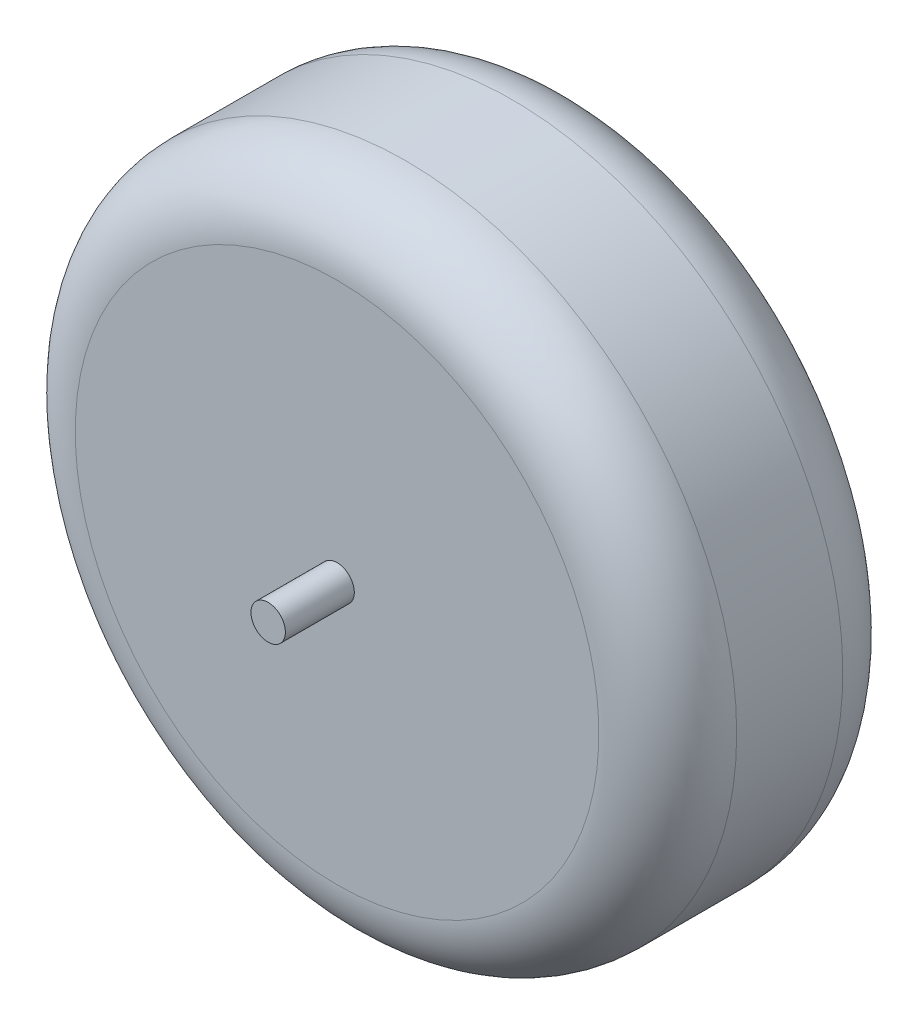
ISO-10303-21;
HEADER;
FILE_DESCRIPTION(('STEP AP214'),'2;1');
FILE_NAME('part.step','',(''),(''),'','','');
FILE_SCHEMA(('AUTOMOTIVE_DESIGN { 1 0 10303 214 1 1 1 1 }'));
ENDSEC;
DATA;
#1=APPLICATION_CONTEXT('core data for automotive mechanical design processes');
#2=APPLICATION_PROTOCOL_DEFINITION('international standard','automotive_design',2000,#1);
#3=PRODUCT_CONTEXT('',#1,'mechanical');
#4=PRODUCT('Part','Part','',(#3));
#5=PRODUCT_RELATED_PRODUCT_CATEGORY('part','',(#4));
#6=PRODUCT_DEFINITION_FORMATION('','',#4);
#7=PRODUCT_DEFINITION_CONTEXT('part definition',#1,'design');
#8=PRODUCT_DEFINITION('design','',#6,#7);
#9=PRODUCT_DEFINITION_SHAPE('','',#8);
#10=(LENGTH_UNIT() NAMED_UNIT(*) SI_UNIT(.MILLI.,.METRE.));
#11=(NAMED_UNIT(*) PLANE_ANGLE_UNIT() SI_UNIT($,.RADIAN.));
#12=(NAMED_UNIT(*) SI_UNIT($,.STERADIAN.) SOLID_ANGLE_UNIT());
#13=UNCERTAINTY_MEASURE_WITH_UNIT(LENGTH_MEASURE(1.E-05),#10,'distance_accuracy_value','');
#14=(GEOMETRIC_REPRESENTATION_CONTEXT(3) GLOBAL_UNCERTAINTY_ASSIGNED_CONTEXT((#13)) GLOBAL_UNIT_ASSIGNED_CONTEXT((#10,
#11,#12)) REPRESENTATION_CONTEXT('',''));
#15=CARTESIAN_POINT('',(0.,0.,0.));
#16=DIRECTION('',(0.,0.,1.));
#17=DIRECTION('',(1.,0.,0.));
#18=AXIS2_PLACEMENT_3D('',#15,#16,#17);
#19=CARTESIAN_POINT('',(0.,0.,13.85));
#20=DIRECTION('',(0.,0.,1.));
#21=DIRECTION('',(1.,0.,0.));
#22=AXIS2_PLACEMENT_3D('',#19,#20,#21);
#23=PLANE('',#22);
#24=CARTESIAN_POINT('',(0.,0.,13.85));
#25=DIRECTION('',(0.,0.,-1.));
#26=DIRECTION('',(-1.,0.,0.));
#27=AXIS2_PLACEMENT_3D('',#24,#25,#26);
#28=CIRCLE('',#27,1.25);
#29=CARTESIAN_POINT('',(-1.25,0.,13.85));
#30=VERTEX_POINT('',#29);
#31=EDGE_CURVE('E243',#30,#30,#28,.T.);
#32=ORIENTED_EDGE('',*,*,#31,.F.);
#33=EDGE_LOOP('',(#32));
#34=FACE_BOUND('',#33,.T.);
#35=ADVANCED_FACE('F17',(#34),#23,.T.);
#36=CARTESIAN_POINT('',(0.,0.,13.85));
#37=DIRECTION('',(0.,0.,-1.));
#38=DIRECTION('',(-1.,0.,0.));
#39=AXIS2_PLACEMENT_3D('',#36,#37,#38);
#40=CYLINDRICAL_SURFACE('',#39,1.25);
#41=CARTESIAN_POINT('',(0.,0.,8.85));
#42=DIRECTION('',(0.,0.,-1.));
#43=DIRECTION('',(-1.,0.,0.));
#44=AXIS2_PLACEMENT_3D('',#41,#42,#43);
#45=CIRCLE('',#44,1.25);
#46=CARTESIAN_POINT('',(-1.25,0.,8.85));
#47=VERTEX_POINT('',#46);
#48=EDGE_CURVE('E50',#47,#47,#45,.T.);
#49=ORIENTED_EDGE('',*,*,#48,.F.);
#50=EDGE_LOOP('',(#49));
#51=FACE_BOUND('',#50,.T.);
#52=ORIENTED_EDGE('',*,*,#31,.T.);
#53=EDGE_LOOP('',(#52));
#54=FACE_BOUND('',#53,.T.);
#55=ADVANCED_FACE('F181',(#51,#54),#40,.T.);
#56=CARTESIAN_POINT('',(0.,0.,8.85));
#57=DIRECTION('',(0.,0.,1.));
#58=DIRECTION('',(1.,0.,0.));
#59=AXIS2_PLACEMENT_3D('',#56,#57,#58);
#60=PLANE('',#59);
#61=CARTESIAN_POINT('',(0.,0.,8.85));
#62=DIRECTION('',(0.,0.,-1.));
#63=DIRECTION('',(0.,1.,0.));
#64=AXIS2_PLACEMENT_3D('',#61,#62,#63);
#65=CIRCLE('',#64,19.);
#66=CARTESIAN_POINT('',(0.,19.,8.85));
#67=VERTEX_POINT('',#66);
#68=CARTESIAN_POINT('',(0.,-19.,8.85));
#69=VERTEX_POINT('',#68);
#70=EDGE_CURVE('E42',#67,#69,#65,.T.);
#71=ORIENTED_EDGE('',*,*,#70,.F.);
#72=CARTESIAN_POINT('',(0.,0.,8.85));
#73=DIRECTION('',(0.,0.,-1.));
#74=DIRECTION('',(0.,-1.,0.));
#75=AXIS2_PLACEMENT_3D('',#72,#73,#74);
#76=CIRCLE('',#75,19.);
#77=EDGE_CURVE('E48',#69,#67,#76,.T.);
#78=ORIENTED_EDGE('',*,*,#77,.F.);
#79=EDGE_LOOP('',(#71,#78));
#80=FACE_BOUND('',#79,.T.);
#81=ORIENTED_EDGE('',*,*,#48,.T.);
#82=EDGE_LOOP('',(#81));
#83=FACE_BOUND('',#82,.T.);
#84=ADVANCED_FACE('F46',(#80,#83),#60,.T.);
#85=CARTESIAN_POINT('',(0.,0.,3.85));
#86=DIRECTION('',(0.,0.,1.));
#87=DIRECTION('',(0.,-1.,0.));
#88=AXIS2_PLACEMENT_3D('',#85,#86,#87);
#89=TOROIDAL_SURFACE('',#88,19.,5.);
#90=CARTESIAN_POINT('',(0.,0.,3.85));
#91=DIRECTION('',(0.,0.,-1.));
#92=DIRECTION('',(-1.,0.,0.));
#93=AXIS2_PLACEMENT_3D('',#90,#91,#92);
#94=CIRCLE('',#93,24.);
#95=CARTESIAN_POINT('',(-24.,0.,3.85));
#96=VERTEX_POINT('',#95);
#97=EDGE_CURVE('E55',#96,#96,#94,.T.);
#98=ORIENTED_EDGE('',*,*,#97,.F.);
#99=EDGE_LOOP('',(#98));
#100=FACE_BOUND('',#99,.T.);
#101=ORIENTED_EDGE('',*,*,#77,.T.);
#102=ORIENTED_EDGE('',*,*,#70,.T.);
#103=EDGE_LOOP('',(#101,#102));
#104=FACE_BOUND('',#103,.T.);
#105=ADVANCED_FACE('F54',(#100,#104),#89,.T.);
#106=CARTESIAN_POINT('',(0.,0.,-13.85));
#107=DIRECTION('',(0.,0.,-1.));
#108=DIRECTION('',(-1.,0.,0.));
#109=AXIS2_PLACEMENT_3D('',#106,#107,#108);
#110=PLANE('',#109);
#111=CARTESIAN_POINT('',(0.,0.,-13.85));
#112=DIRECTION('',(0.,0.,1.));
#113=DIRECTION('',(1.,0.,0.));
#114=AXIS2_PLACEMENT_3D('',#111,#112,#113);
#115=CIRCLE('',#114,1.25);
#116=CARTESIAN_POINT('',(1.25,0.,-13.85));
#117=VERTEX_POINT('',#116);
#118=EDGE_CURVE('E83',#117,#117,#115,.T.);
#119=ORIENTED_EDGE('',*,*,#118,.F.);
#120=EDGE_LOOP('',(#119));
#121=FACE_BOUND('',#120,.T.);
#122=ADVANCED_FACE('F74',(#121),#110,.T.);
#123=CARTESIAN_POINT('',(0.,0.,8.85));
#124=DIRECTION('',(0.,0.,-1.));
#125=DIRECTION('',(-1.,0.,0.));
#126=AXIS2_PLACEMENT_3D('',#123,#124,#125);
#127=CYLINDRICAL_SURFACE('',#126,24.);
#128=ORIENTED_EDGE('',*,*,#97,.T.);
#129=EDGE_LOOP('',(#128));
#130=FACE_BOUND('',#129,.T.);
#131=CARTESIAN_POINT('',(0.,0.,-3.85));
#132=DIRECTION('',(0.,0.,1.));
#133=DIRECTION('',(0.,-1.,0.));
#134=AXIS2_PLACEMENT_3D('',#131,#132,#133);
#135=CIRCLE('',#134,24.);
#136=CARTESIAN_POINT('',(0.,-24.,-3.85));
#137=VERTEX_POINT('',#136);
#138=EDGE_CURVE('E84',#137,#137,#135,.F.);
#139=ORIENTED_EDGE('',*,*,#138,.F.);
#140=EDGE_LOOP('',(#139));
#141=FACE_BOUND('',#140,.T.);
#142=ADVANCED_FACE('F130',(#130,#141),#127,.T.);
#143=CARTESIAN_POINT('',(0.,0.,-13.85));
#144=DIRECTION('',(0.,0.,1.));
#145=DIRECTION('',(1.,0.,0.));
#146=AXIS2_PLACEMENT_3D('',#143,#144,#145);
#147=CYLINDRICAL_SURFACE('',#146,1.25);
#148=ORIENTED_EDGE('',*,*,#118,.T.);
#149=EDGE_LOOP('',(#148));
#150=FACE_BOUND('',#149,.T.);
#151=CARTESIAN_POINT('',(0.,0.,-8.85));
#152=DIRECTION('',(0.,0.,1.));
#153=DIRECTION('',(1.,0.,0.));
#154=AXIS2_PLACEMENT_3D('',#151,#152,#153);
#155=CIRCLE('',#154,1.25);
#156=CARTESIAN_POINT('',(1.25,0.,-8.85));
#157=VERTEX_POINT('',#156);
#158=EDGE_CURVE('E64',#157,#157,#155,.F.);
#159=ORIENTED_EDGE('',*,*,#158,.T.);
#160=EDGE_LOOP('',(#159));
#161=FACE_BOUND('',#160,.T.);
#162=ADVANCED_FACE('F103',(#150,#161),#147,.T.);
#163=CARTESIAN_POINT('',(0.,0.,-3.85));
#164=DIRECTION('',(0.,0.,1.));
#165=DIRECTION('',(0.,-1.,0.));
#166=AXIS2_PLACEMENT_3D('',#163,#164,#165);
#167=TOROIDAL_SURFACE('',#166,19.,5.);
#168=CARTESIAN_POINT('',(0.,0.,-8.85));
#169=DIRECTION('',(0.,0.,1.));
#170=DIRECTION('',(0.,-1.,0.));
#171=AXIS2_PLACEMENT_3D('',#168,#169,#170);
#172=CIRCLE('',#171,19.);
#173=CARTESIAN_POINT('',(0.,-19.,-8.85));
#174=VERTEX_POINT('',#173);
#175=CARTESIAN_POINT('',(0.,19.,-8.85));
#176=VERTEX_POINT('',#175);
#177=EDGE_CURVE('E28',#174,#176,#172,.T.);
#178=ORIENTED_EDGE('',*,*,#177,.T.);
#179=CARTESIAN_POINT('',(0.,0.,-8.85));
#180=DIRECTION('',(0.,0.,1.));
#181=DIRECTION('',(0.,1.,0.));
#182=AXIS2_PLACEMENT_3D('',#179,#180,#181);
#183=CIRCLE('',#182,19.);
#184=EDGE_CURVE('E11',#176,#174,#183,.T.);
#185=ORIENTED_EDGE('',*,*,#184,.T.);
#186=EDGE_LOOP('',(#178,#185));
#187=FACE_BOUND('',#186,.T.);
#188=ORIENTED_EDGE('',*,*,#138,.T.);
#189=EDGE_LOOP('',(#188));
#190=FACE_BOUND('',#189,.T.);
#191=ADVANCED_FACE('F92',(#187,#190),#167,.T.);
#192=CARTESIAN_POINT('',(0.,0.,-8.85));
#193=DIRECTION('',(0.,0.,1.));
#194=DIRECTION('',(1.,0.,0.));
#195=AXIS2_PLACEMENT_3D('',#192,#193,#194);
#196=PLANE('',#195);
#197=ORIENTED_EDGE('',*,*,#177,.F.);
#198=ORIENTED_EDGE('',*,*,#184,.F.);
#199=EDGE_LOOP('',(#197,#198));
#200=FACE_BOUND('',#199,.T.);
#201=ORIENTED_EDGE('',*,*,#158,.F.);
#202=EDGE_LOOP('',(#201));
#203=FACE_BOUND('',#202,.T.);
#204=ADVANCED_FACE('F102',(#200,#203),#196,.F.);
#205=CLOSED_SHELL('',(#35,#55,#84,#105,#122,#142,#162,#191,#204));
#206=MANIFOLD_SOLID_BREP('B1',#205);
#207=ADVANCED_BREP_SHAPE_REPRESENTATION('',(#18,#206),#14);
#208=SHAPE_DEFINITION_REPRESENTATION(#9,#207);
ENDSEC;
END-ISO-10303-21;
